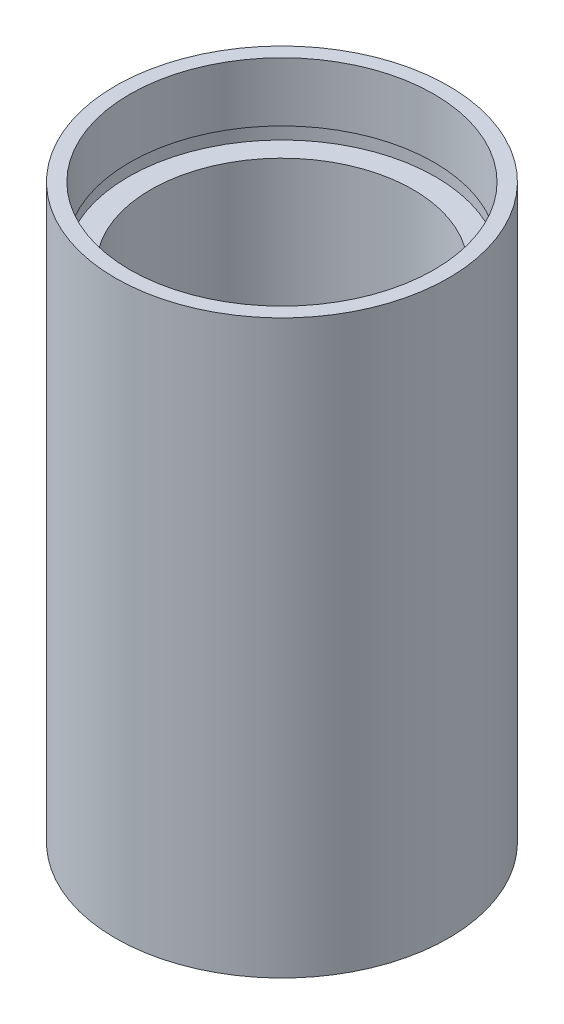
ISO-10303-21;
HEADER;
FILE_DESCRIPTION(('STEP AP214'),'2;1');
FILE_NAME('part.step','',(''),(''),'','','');
FILE_SCHEMA(('AUTOMOTIVE_DESIGN { 1 0 10303 214 1 1 1 1 }'));
ENDSEC;
DATA;
#1=APPLICATION_CONTEXT('core data for automotive mechanical design processes');
#2=APPLICATION_PROTOCOL_DEFINITION('international standard','automotive_design',2000,#1);
#3=PRODUCT_CONTEXT('',#1,'mechanical');
#4=PRODUCT('Part','Part','',(#3));
#5=PRODUCT_RELATED_PRODUCT_CATEGORY('part','',(#4));
#6=PRODUCT_DEFINITION_FORMATION('','',#4);
#7=PRODUCT_DEFINITION_CONTEXT('part definition',#1,'design');
#8=PRODUCT_DEFINITION('design','',#6,#7);
#9=PRODUCT_DEFINITION_SHAPE('','',#8);
#10=(LENGTH_UNIT() NAMED_UNIT(*) SI_UNIT(.MILLI.,.METRE.));
#11=(NAMED_UNIT(*) PLANE_ANGLE_UNIT() SI_UNIT($,.RADIAN.));
#12=(NAMED_UNIT(*) SI_UNIT($,.STERADIAN.) SOLID_ANGLE_UNIT());
#13=UNCERTAINTY_MEASURE_WITH_UNIT(LENGTH_MEASURE(1.E-05),#10,'distance_accuracy_value','');
#14=(GEOMETRIC_REPRESENTATION_CONTEXT(3) GLOBAL_UNCERTAINTY_ASSIGNED_CONTEXT((#13)) GLOBAL_UNIT_ASSIGNED_CONTEXT((#10,
#11,#12)) REPRESENTATION_CONTEXT('',''));
#15=CARTESIAN_POINT('',(0.,0.,0.));
#16=DIRECTION('',(0.,0.,1.));
#17=DIRECTION('',(1.,0.,0.));
#18=AXIS2_PLACEMENT_3D('',#15,#16,#17);
#19=CARTESIAN_POINT('',(11.1,0.,0.));
#20=DIRECTION('',(0.,1.,0.));
#21=DIRECTION('',(0.,0.,1.));
#22=AXIS2_PLACEMENT_3D('',#19,#20,#21);
#23=PLANE('',#22);
#24=CARTESIAN_POINT('',(0.,0.,0.));
#25=DIRECTION('',(0.,1.,0.));
#26=DIRECTION('',(0.,0.,1.));
#27=AXIS2_PLACEMENT_3D('',#24,#25,#26);
#28=CIRCLE('',#27,12.7);
#29=CARTESIAN_POINT('',(0.,0.,12.7));
#30=VERTEX_POINT('',#29);
#31=EDGE_CURVE('E10',#30,#30,#28,.T.);
#32=ORIENTED_EDGE('',*,*,#31,.F.);
#33=EDGE_LOOP('',(#32));
#34=FACE_BOUND('',#33,.T.);
#35=CARTESIAN_POINT('',(0.,0.,0.));
#36=DIRECTION('',(0.,1.,0.));
#37=DIRECTION('',(0.,0.,1.));
#38=AXIS2_PLACEMENT_3D('',#35,#36,#37);
#39=CIRCLE('',#38,11.1);
#40=CARTESIAN_POINT('',(0.,0.,11.1));
#41=VERTEX_POINT('',#40);
#42=EDGE_CURVE('E77',#41,#41,#39,.T.);
#43=ORIENTED_EDGE('',*,*,#42,.T.);
#44=EDGE_LOOP('',(#43));
#45=FACE_BOUND('',#44,.T.);
#46=ADVANCED_FACE('F37',(#34,#45),#23,.F.);
#47=CARTESIAN_POINT('',(0.,161.376166943427,0.));
#48=DIRECTION('',(0.,1.,0.));
#49=DIRECTION('',(0.,0.,1.));
#50=AXIS2_PLACEMENT_3D('',#47,#48,#49);
#51=CYLINDRICAL_SURFACE('',#50,12.7);
#52=CARTESIAN_POINT('',(0.,43.6,0.));
#53=DIRECTION('',(0.,1.,0.));
#54=DIRECTION('',(0.,0.,1.));
#55=AXIS2_PLACEMENT_3D('',#52,#53,#54);
#56=CIRCLE('',#55,12.7);
#57=CARTESIAN_POINT('',(0.,43.6,12.7));
#58=VERTEX_POINT('',#57);
#59=EDGE_CURVE('E43',#58,#58,#56,.T.);
#60=ORIENTED_EDGE('',*,*,#59,.F.);
#61=EDGE_LOOP('',(#60));
#62=FACE_BOUND('',#61,.T.);
#63=ORIENTED_EDGE('',*,*,#31,.T.);
#64=EDGE_LOOP('',(#63));
#65=FACE_BOUND('',#64,.T.);
#66=ADVANCED_FACE('F138',(#62,#65),#51,.T.);
#67=CARTESIAN_POINT('',(11.6,43.6,0.));
#68=DIRECTION('',(0.,-1.,0.));
#69=DIRECTION('',(0.,0.,-1.));
#70=AXIS2_PLACEMENT_3D('',#67,#68,#69);
#71=PLANE('',#70);
#72=CARTESIAN_POINT('',(0.,43.6,0.));
#73=DIRECTION('',(0.,1.,0.));
#74=DIRECTION('',(0.,0.,1.));
#75=AXIS2_PLACEMENT_3D('',#72,#73,#74);
#76=CIRCLE('',#75,11.6);
#77=CARTESIAN_POINT('',(0.,43.6,11.6));
#78=VERTEX_POINT('',#77);
#79=EDGE_CURVE('E47',#78,#78,#76,.T.);
#80=ORIENTED_EDGE('',*,*,#79,.F.);
#81=EDGE_LOOP('',(#80));
#82=FACE_BOUND('',#81,.T.);
#83=ORIENTED_EDGE('',*,*,#59,.T.);
#84=EDGE_LOOP('',(#83));
#85=FACE_BOUND('',#84,.T.);
#86=ADVANCED_FACE('F133',(#82,#85),#71,.F.);
#87=CARTESIAN_POINT('',(0.,161.376166943427,0.));
#88=DIRECTION('',(0.,1.,0.));
#89=DIRECTION('',(0.,0.,1.));
#90=AXIS2_PLACEMENT_3D('',#87,#88,#89);
#91=CYLINDRICAL_SURFACE('',#90,11.6);
#92=CARTESIAN_POINT('',(0.,39.1,0.));
#93=DIRECTION('',(0.,1.,0.));
#94=DIRECTION('',(0.,0.,1.));
#95=AXIS2_PLACEMENT_3D('',#92,#93,#94);
#96=CIRCLE('',#95,11.6);
#97=CARTESIAN_POINT('',(0.,39.1,11.6));
#98=VERTEX_POINT('',#97);
#99=EDGE_CURVE('E51',#98,#98,#96,.T.);
#100=ORIENTED_EDGE('',*,*,#99,.F.);
#101=EDGE_LOOP('',(#100));
#102=FACE_BOUND('',#101,.T.);
#103=ORIENTED_EDGE('',*,*,#79,.T.);
#104=EDGE_LOOP('',(#103));
#105=FACE_BOUND('',#104,.T.);
#106=ADVANCED_FACE('F127',(#102,#105),#91,.F.);
#107=CARTESIAN_POINT('',(11.6,39.1,0.));
#108=DIRECTION('',(0.,1.,0.));
#109=DIRECTION('',(0.,0.,1.));
#110=AXIS2_PLACEMENT_3D('',#107,#108,#109);
#111=PLANE('',#110);
#112=CARTESIAN_POINT('',(0.,39.1,0.));
#113=DIRECTION('',(0.,1.,0.));
#114=DIRECTION('',(0.,0.,1.));
#115=AXIS2_PLACEMENT_3D('',#112,#113,#114);
#116=CIRCLE('',#115,11.7);
#117=CARTESIAN_POINT('',(0.,39.1,11.7));
#118=VERTEX_POINT('',#117);
#119=EDGE_CURVE('E56',#118,#118,#116,.T.);
#120=ORIENTED_EDGE('',*,*,#119,.F.);
#121=EDGE_LOOP('',(#120));
#122=FACE_BOUND('',#121,.T.);
#123=ORIENTED_EDGE('',*,*,#99,.T.);
#124=EDGE_LOOP('',(#123));
#125=FACE_BOUND('',#124,.T.);
#126=ADVANCED_FACE('F121',(#122,#125),#111,.F.);
#127=CARTESIAN_POINT('',(0.,161.376166943427,0.));
#128=DIRECTION('',(0.,1.,0.));
#129=DIRECTION('',(0.,0.,1.));
#130=AXIS2_PLACEMENT_3D('',#127,#128,#129);
#131=CYLINDRICAL_SURFACE('',#130,11.7);
#132=CARTESIAN_POINT('',(0.,38.1,0.));
#133=DIRECTION('',(0.,1.,0.));
#134=DIRECTION('',(0.,0.,1.));
#135=AXIS2_PLACEMENT_3D('',#132,#133,#134);
#136=CIRCLE('',#135,11.7);
#137=CARTESIAN_POINT('',(0.,38.1,11.7));
#138=VERTEX_POINT('',#137);
#139=EDGE_CURVE('E59',#138,#138,#136,.T.);
#140=ORIENTED_EDGE('',*,*,#139,.F.);
#141=EDGE_LOOP('',(#140));
#142=FACE_BOUND('',#141,.T.);
#143=ORIENTED_EDGE('',*,*,#119,.T.);
#144=EDGE_LOOP('',(#143));
#145=FACE_BOUND('',#144,.T.);
#146=ADVANCED_FACE('F115',(#142,#145),#131,.F.);
#147=CARTESIAN_POINT('',(10.,38.1,0.));
#148=DIRECTION('',(0.,-1.,0.));
#149=DIRECTION('',(0.,0.,-1.));
#150=AXIS2_PLACEMENT_3D('',#147,#148,#149);
#151=PLANE('',#150);
#152=CARTESIAN_POINT('',(0.,38.1,0.));
#153=DIRECTION('',(0.,1.,0.));
#154=DIRECTION('',(0.,0.,1.));
#155=AXIS2_PLACEMENT_3D('',#152,#153,#154);
#156=CIRCLE('',#155,10.);
#157=CARTESIAN_POINT('',(0.,38.1,10.));
#158=VERTEX_POINT('',#157);
#159=EDGE_CURVE('E62',#158,#158,#156,.T.);
#160=ORIENTED_EDGE('',*,*,#159,.F.);
#161=EDGE_LOOP('',(#160));
#162=FACE_BOUND('',#161,.T.);
#163=ORIENTED_EDGE('',*,*,#139,.T.);
#164=EDGE_LOOP('',(#163));
#165=FACE_BOUND('',#164,.T.);
#166=ADVANCED_FACE('F109',(#162,#165),#151,.F.);
#167=CARTESIAN_POINT('',(0.,161.376166943427,0.));
#168=DIRECTION('',(0.,1.,0.));
#169=DIRECTION('',(0.,0.,1.));
#170=AXIS2_PLACEMENT_3D('',#167,#168,#169);
#171=CYLINDRICAL_SURFACE('',#170,10.);
#172=CARTESIAN_POINT('',(0.,5.49999999999998,0.));
#173=DIRECTION('',(0.,1.,0.));
#174=DIRECTION('',(0.,0.,1.));
#175=AXIS2_PLACEMENT_3D('',#172,#173,#174);
#176=CIRCLE('',#175,10.);
#177=CARTESIAN_POINT('',(0.,5.49999999999998,10.));
#178=VERTEX_POINT('',#177);
#179=EDGE_CURVE('E65',#178,#178,#176,.T.);
#180=ORIENTED_EDGE('',*,*,#179,.F.);
#181=EDGE_LOOP('',(#180));
#182=FACE_BOUND('',#181,.T.);
#183=ORIENTED_EDGE('',*,*,#159,.T.);
#184=EDGE_LOOP('',(#183));
#185=FACE_BOUND('',#184,.T.);
#186=ADVANCED_FACE('F103',(#182,#185),#171,.F.);
#187=CARTESIAN_POINT('',(11.7,5.49999999999998,0.));
#188=DIRECTION('',(0.,1.,0.));
#189=DIRECTION('',(0.,0.,1.));
#190=AXIS2_PLACEMENT_3D('',#187,#188,#189);
#191=PLANE('',#190);
#192=CARTESIAN_POINT('',(0.,5.49999999999998,0.));
#193=DIRECTION('',(0.,1.,0.));
#194=DIRECTION('',(0.,0.,1.));
#195=AXIS2_PLACEMENT_3D('',#192,#193,#194);
#196=CIRCLE('',#195,11.7);
#197=CARTESIAN_POINT('',(0.,5.49999999999998,11.7));
#198=VERTEX_POINT('',#197);
#199=EDGE_CURVE('E68',#198,#198,#196,.T.);
#200=ORIENTED_EDGE('',*,*,#199,.F.);
#201=EDGE_LOOP('',(#200));
#202=FACE_BOUND('',#201,.T.);
#203=ORIENTED_EDGE('',*,*,#179,.T.);
#204=EDGE_LOOP('',(#203));
#205=FACE_BOUND('',#204,.T.);
#206=ADVANCED_FACE('F97',(#202,#205),#191,.F.);
#207=CARTESIAN_POINT('',(0.,161.376166943427,0.));
#208=DIRECTION('',(0.,1.,0.));
#209=DIRECTION('',(0.,0.,1.));
#210=AXIS2_PLACEMENT_3D('',#207,#208,#209);
#211=CYLINDRICAL_SURFACE('',#210,11.7);
#212=CARTESIAN_POINT('',(0.,4.49999999999998,0.));
#213=DIRECTION('',(0.,1.,0.));
#214=DIRECTION('',(0.,0.,1.));
#215=AXIS2_PLACEMENT_3D('',#212,#213,#214);
#216=CIRCLE('',#215,11.7);
#217=CARTESIAN_POINT('',(0.,4.49999999999998,11.7));
#218=VERTEX_POINT('',#217);
#219=EDGE_CURVE('E71',#218,#218,#216,.T.);
#220=ORIENTED_EDGE('',*,*,#219,.F.);
#221=EDGE_LOOP('',(#220));
#222=FACE_BOUND('',#221,.T.);
#223=ORIENTED_EDGE('',*,*,#199,.T.);
#224=EDGE_LOOP('',(#223));
#225=FACE_BOUND('',#224,.T.);
#226=ADVANCED_FACE('F91',(#222,#225),#211,.F.);
#227=CARTESIAN_POINT('',(11.1,4.49999999999998,0.));
#228=DIRECTION('',(0.,-1.,0.));
#229=DIRECTION('',(0.,0.,-1.));
#230=AXIS2_PLACEMENT_3D('',#227,#228,#229);
#231=PLANE('',#230);
#232=CARTESIAN_POINT('',(0.,4.49999999999998,0.));
#233=DIRECTION('',(0.,1.,0.));
#234=DIRECTION('',(0.,0.,1.));
#235=AXIS2_PLACEMENT_3D('',#232,#233,#234);
#236=CIRCLE('',#235,11.1);
#237=CARTESIAN_POINT('',(0.,4.49999999999998,11.1));
#238=VERTEX_POINT('',#237);
#239=EDGE_CURVE('E74',#238,#238,#236,.T.);
#240=ORIENTED_EDGE('',*,*,#239,.F.);
#241=EDGE_LOOP('',(#240));
#242=FACE_BOUND('',#241,.T.);
#243=ORIENTED_EDGE('',*,*,#219,.T.);
#244=EDGE_LOOP('',(#243));
#245=FACE_BOUND('',#244,.T.);
#246=ADVANCED_FACE('F85',(#242,#245),#231,.F.);
#247=CARTESIAN_POINT('',(0.,161.376166943427,0.));
#248=DIRECTION('',(0.,1.,0.));
#249=DIRECTION('',(0.,0.,1.));
#250=AXIS2_PLACEMENT_3D('',#247,#248,#249);
#251=CYLINDRICAL_SURFACE('',#250,11.1);
#252=ORIENTED_EDGE('',*,*,#42,.F.);
#253=EDGE_LOOP('',(#252));
#254=FACE_BOUND('',#253,.T.);
#255=ORIENTED_EDGE('',*,*,#239,.T.);
#256=EDGE_LOOP('',(#255));
#257=FACE_BOUND('',#256,.T.);
#258=ADVANCED_FACE('F82',(#254,#257),#251,.F.);
#259=CLOSED_SHELL('',(#46,#66,#86,#106,#126,#146,#166,#186,#206,#226,#246,#258));
#260=MANIFOLD_SOLID_BREP('B2',#259);
#261=ADVANCED_BREP_SHAPE_REPRESENTATION('',(#18,#260),#14);
#262=SHAPE_DEFINITION_REPRESENTATION(#9,#261);
ENDSEC;
END-ISO-10303-21;
